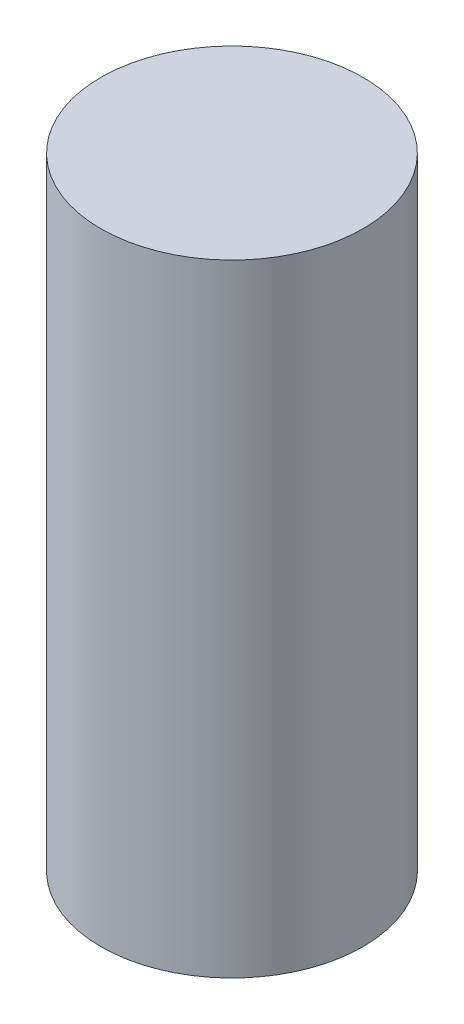
ISO-10303-21;
HEADER;
FILE_DESCRIPTION(('STEP AP214'),'2;1');
FILE_NAME('part.step','',(''),(''),'','','');
FILE_SCHEMA(('AUTOMOTIVE_DESIGN { 1 0 10303 214 1 1 1 1 }'));
ENDSEC;
DATA;
#1=APPLICATION_CONTEXT('core data for automotive mechanical design processes');
#2=APPLICATION_PROTOCOL_DEFINITION('international standard','automotive_design',2000,#1);
#3=PRODUCT_CONTEXT('',#1,'mechanical');
#4=PRODUCT('Part','Part','',(#3));
#5=PRODUCT_RELATED_PRODUCT_CATEGORY('part','',(#4));
#6=PRODUCT_DEFINITION_FORMATION('','',#4);
#7=PRODUCT_DEFINITION_CONTEXT('part definition',#1,'design');
#8=PRODUCT_DEFINITION('design','',#6,#7);
#9=PRODUCT_DEFINITION_SHAPE('','',#8);
#10=(LENGTH_UNIT() NAMED_UNIT(*) SI_UNIT(.MILLI.,.METRE.));
#11=(NAMED_UNIT(*) PLANE_ANGLE_UNIT() SI_UNIT($,.RADIAN.));
#12=(NAMED_UNIT(*) SI_UNIT($,.STERADIAN.) SOLID_ANGLE_UNIT());
#13=UNCERTAINTY_MEASURE_WITH_UNIT(LENGTH_MEASURE(1.E-05),#10,'distance_accuracy_value','');
#14=(GEOMETRIC_REPRESENTATION_CONTEXT(3) GLOBAL_UNCERTAINTY_ASSIGNED_CONTEXT((#13)) GLOBAL_UNIT_ASSIGNED_CONTEXT((#10,
#11,#12)) REPRESENTATION_CONTEXT('',''));
#15=CARTESIAN_POINT('',(0.,0.,0.));
#16=DIRECTION('',(0.,0.,1.));
#17=DIRECTION('',(1.,0.,0.));
#18=AXIS2_PLACEMENT_3D('',#15,#16,#17);
#19=CARTESIAN_POINT('',(0.,29.21,0.));
#20=DIRECTION('',(0.,-1.,0.));
#21=DIRECTION('',(0.,0.,-1.));
#22=AXIS2_PLACEMENT_3D('',#19,#20,#21);
#23=CYLINDRICAL_SURFACE('',#22,6.1595);
#24=CARTESIAN_POINT('',(0.,29.21,0.));
#25=DIRECTION('',(0.,1.,0.));
#26=DIRECTION('',(0.,0.,1.));
#27=AXIS2_PLACEMENT_3D('',#24,#25,#26);
#28=CIRCLE('',#27,6.1595);
#29=CARTESIAN_POINT('',(0.,29.21,6.1595));
#30=VERTEX_POINT('',#29);
#31=EDGE_CURVE('E10',#30,#30,#28,.T.);
#32=ORIENTED_EDGE('',*,*,#31,.F.);
#33=EDGE_LOOP('',(#32));
#34=FACE_BOUND('',#33,.T.);
#35=CARTESIAN_POINT('',(0.,0.,0.));
#36=DIRECTION('',(0.,1.,0.));
#37=DIRECTION('',(0.,0.,1.));
#38=AXIS2_PLACEMENT_3D('',#35,#36,#37);
#39=CIRCLE('',#38,6.1595);
#40=CARTESIAN_POINT('',(0.,0.,6.1595));
#41=VERTEX_POINT('',#40);
#42=EDGE_CURVE('E34',#41,#41,#39,.T.);
#43=ORIENTED_EDGE('',*,*,#42,.T.);
#44=EDGE_LOOP('',(#43));
#45=FACE_BOUND('',#44,.T.);
#46=ADVANCED_FACE('F31',(#34,#45),#23,.T.);
#47=CARTESIAN_POINT('',(0.,29.21,0.));
#48=DIRECTION('',(0.,1.,0.));
#49=DIRECTION('',(0.,0.,1.));
#50=AXIS2_PLACEMENT_3D('',#47,#48,#49);
#51=PLANE('',#50);
#52=ORIENTED_EDGE('',*,*,#31,.T.);
#53=EDGE_LOOP('',(#52));
#54=FACE_BOUND('',#53,.T.);
#55=ADVANCED_FACE('F46',(#54),#51,.T.);
#56=CARTESIAN_POINT('',(0.,0.,0.));
#57=DIRECTION('',(0.,1.,0.));
#58=DIRECTION('',(0.,0.,1.));
#59=AXIS2_PLACEMENT_3D('',#56,#57,#58);
#60=PLANE('',#59);
#61=ORIENTED_EDGE('',*,*,#42,.F.);
#62=EDGE_LOOP('',(#61));
#63=FACE_BOUND('',#62,.T.);
#64=ADVANCED_FACE('F44',(#63),#60,.F.);
#65=CLOSED_SHELL('',(#46,#55,#64));
#66=MANIFOLD_SOLID_BREP('B2',#65);
#67=ADVANCED_BREP_SHAPE_REPRESENTATION('',(#18,#66),#14);
#68=SHAPE_DEFINITION_REPRESENTATION(#9,#67);
ENDSEC;
END-ISO-10303-21;
